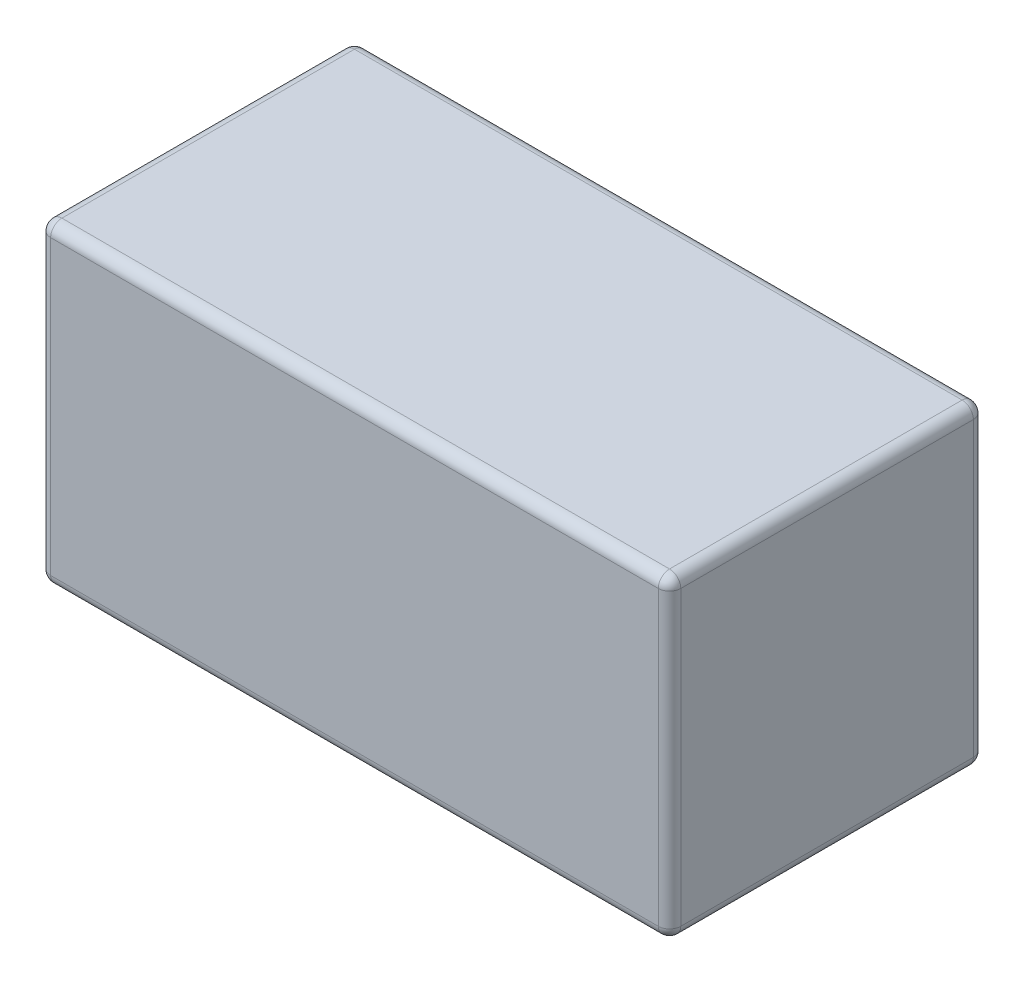
ISO-10303-21;
HEADER;
FILE_DESCRIPTION(('STEP AP214'),'2;1');
FILE_NAME('part.step','',(''),(''),'','','');
FILE_SCHEMA(('AUTOMOTIVE_DESIGN { 1 0 10303 214 1 1 1 1 }'));
ENDSEC;
DATA;
#1=APPLICATION_CONTEXT('core data for automotive mechanical design processes');
#2=APPLICATION_PROTOCOL_DEFINITION('international standard','automotive_design',2000,#1);
#3=PRODUCT_CONTEXT('',#1,'mechanical');
#4=PRODUCT('Part','Part','',(#3));
#5=PRODUCT_RELATED_PRODUCT_CATEGORY('part','',(#4));
#6=PRODUCT_DEFINITION_FORMATION('','',#4);
#7=PRODUCT_DEFINITION_CONTEXT('part definition',#1,'design');
#8=PRODUCT_DEFINITION('design','',#6,#7);
#9=PRODUCT_DEFINITION_SHAPE('','',#8);
#10=(LENGTH_UNIT() NAMED_UNIT(*) SI_UNIT(.MILLI.,.METRE.));
#11=(NAMED_UNIT(*) PLANE_ANGLE_UNIT() SI_UNIT($,.RADIAN.));
#12=(NAMED_UNIT(*) SI_UNIT($,.STERADIAN.) SOLID_ANGLE_UNIT());
#13=UNCERTAINTY_MEASURE_WITH_UNIT(LENGTH_MEASURE(1.E-05),#10,'distance_accuracy_value','');
#14=(GEOMETRIC_REPRESENTATION_CONTEXT(3) GLOBAL_UNCERTAINTY_ASSIGNED_CONTEXT((#13)) GLOBAL_UNIT_ASSIGNED_CONTEXT((#10,
#11,#12)) REPRESENTATION_CONTEXT('',''));
#15=CARTESIAN_POINT('',(0.,0.,0.));
#16=DIRECTION('',(0.,0.,1.));
#17=DIRECTION('',(1.,0.,0.));
#18=AXIS2_PLACEMENT_3D('',#15,#16,#17);
#19=CARTESIAN_POINT('',(0.,35.56,0.));
#20=DIRECTION('',(1.,0.,0.));
#21=DIRECTION('',(0.,0.,-1.));
#22=AXIS2_PLACEMENT_3D('',#19,#20,#21);
#23=PLANE('',#22);
#24=DIRECTION('',(0.,-1.,0.));
#25=VECTOR('',#24,1.);
#26=CARTESIAN_POINT('',(0.,35.56,-34.29));
#27=LINE('',#26,#25);
#28=CARTESIAN_POINT('',(0.,34.29,-34.29));
#29=VERTEX_POINT('',#28);
#30=CARTESIAN_POINT('',(0.,1.27,-34.29));
#31=VERTEX_POINT('',#30);
#32=EDGE_CURVE('E143',#29,#31,#27,.T.);
#33=ORIENTED_EDGE('',*,*,#32,.T.);
#34=DIRECTION('',(0.,0.,1.));
#35=VECTOR('',#34,1.);
#36=CARTESIAN_POINT('',(0.,1.27,0.));
#37=LINE('',#36,#35);
#38=CARTESIAN_POINT('',(0.,1.27,-1.27));
#39=VERTEX_POINT('',#38);
#40=EDGE_CURVE('E138',#31,#39,#37,.T.);
#41=ORIENTED_EDGE('',*,*,#40,.T.);
#42=DIRECTION('',(0.,-1.,0.));
#43=VECTOR('',#42,1.);
#44=CARTESIAN_POINT('',(0.,35.56,-1.27));
#45=LINE('',#44,#43);
#46=CARTESIAN_POINT('',(0.,34.29,-1.27));
#47=VERTEX_POINT('',#46);
#48=EDGE_CURVE('E133',#39,#47,#45,.F.);
#49=ORIENTED_EDGE('',*,*,#48,.T.);
#50=DIRECTION('',(0.,0.,1.));
#51=VECTOR('',#50,1.);
#52=CARTESIAN_POINT('',(0.,34.29,0.));
#53=LINE('',#52,#51);
#54=EDGE_CURVE('E135',#47,#29,#53,.F.);
#55=ORIENTED_EDGE('',*,*,#54,.T.);
#56=EDGE_LOOP('',(#33,#41,#49,#55));
#57=FACE_BOUND('',#56,.T.);
#58=ADVANCED_FACE('F43',(#57),#23,.F.);
#59=CARTESIAN_POINT('',(0.,35.56,0.));
#60=DIRECTION('',(0.,0.,-1.));
#61=DIRECTION('',(-1.,0.,0.));
#62=AXIS2_PLACEMENT_3D('',#59,#60,#61);
#63=PLANE('',#62);
#64=DIRECTION('',(0.,-1.,0.));
#65=VECTOR('',#64,1.);
#66=CARTESIAN_POINT('',(1.27,35.56,0.));
#67=LINE('',#66,#65);
#68=CARTESIAN_POINT('',(1.27,34.29,0.));
#69=VERTEX_POINT('',#68);
#70=CARTESIAN_POINT('',(1.27,1.27,0.));
#71=VERTEX_POINT('',#70);
#72=EDGE_CURVE('E166',#69,#71,#67,.T.);
#73=ORIENTED_EDGE('',*,*,#72,.T.);
#74=DIRECTION('',(1.,0.,0.));
#75=VECTOR('',#74,1.);
#76=CARTESIAN_POINT('',(71.12,1.27,0.));
#77=LINE('',#76,#75);
#78=CARTESIAN_POINT('',(69.85,1.27,0.));
#79=VERTEX_POINT('',#78);
#80=EDGE_CURVE('E266',#71,#79,#77,.T.);
#81=ORIENTED_EDGE('',*,*,#80,.T.);
#82=DIRECTION('',(0.,-1.,0.));
#83=VECTOR('',#82,1.);
#84=CARTESIAN_POINT('',(69.85,35.56,0.));
#85=LINE('',#84,#83);
#86=CARTESIAN_POINT('',(69.85,34.29,0.));
#87=VERTEX_POINT('',#86);
#88=EDGE_CURVE('E257',#79,#87,#85,.F.);
#89=ORIENTED_EDGE('',*,*,#88,.T.);
#90=DIRECTION('',(1.,0.,0.));
#91=VECTOR('',#90,1.);
#92=CARTESIAN_POINT('',(0.,34.29,0.));
#93=LINE('',#92,#91);
#94=EDGE_CURVE('E253',#87,#69,#93,.F.);
#95=ORIENTED_EDGE('',*,*,#94,.T.);
#96=EDGE_LOOP('',(#73,#81,#89,#95));
#97=FACE_BOUND('',#96,.T.);
#98=ADVANCED_FACE('F378',(#97),#63,.F.);
#99=CARTESIAN_POINT('',(71.12,35.56,0.));
#100=DIRECTION('',(-1.,0.,0.));
#101=DIRECTION('',(0.,0.,1.));
#102=AXIS2_PLACEMENT_3D('',#99,#100,#101);
#103=PLANE('',#102);
#104=DIRECTION('',(0.,0.,-1.));
#105=VECTOR('',#104,1.);
#106=CARTESIAN_POINT('',(71.12,1.27,-35.56));
#107=LINE('',#106,#105);
#108=CARTESIAN_POINT('',(71.12,1.27,-1.27));
#109=VERTEX_POINT('',#108);
#110=CARTESIAN_POINT('',(71.12,1.27,-34.29));
#111=VERTEX_POINT('',#110);
#112=EDGE_CURVE('E248',#109,#111,#107,.T.);
#113=ORIENTED_EDGE('',*,*,#112,.T.);
#114=DIRECTION('',(0.,-1.,0.));
#115=VECTOR('',#114,1.);
#116=CARTESIAN_POINT('',(71.12,35.56,-34.29));
#117=LINE('',#116,#115);
#118=CARTESIAN_POINT('',(71.12,34.29,-34.29));
#119=VERTEX_POINT('',#118);
#120=EDGE_CURVE('E245',#111,#119,#117,.F.);
#121=ORIENTED_EDGE('',*,*,#120,.T.);
#122=DIRECTION('',(0.,0.,-1.));
#123=VECTOR('',#122,1.);
#124=CARTESIAN_POINT('',(71.12,34.29,0.));
#125=LINE('',#124,#123);
#126=CARTESIAN_POINT('',(71.12,34.29,-1.27));
#127=VERTEX_POINT('',#126);
#128=EDGE_CURVE('E237',#119,#127,#125,.F.);
#129=ORIENTED_EDGE('',*,*,#128,.T.);
#130=DIRECTION('',(0.,-1.,0.));
#131=VECTOR('',#130,1.);
#132=CARTESIAN_POINT('',(71.12,35.56,-1.27));
#133=LINE('',#132,#131);
#134=EDGE_CURVE('E241',#127,#109,#133,.T.);
#135=ORIENTED_EDGE('',*,*,#134,.T.);
#136=EDGE_LOOP('',(#113,#121,#129,#135));
#137=FACE_BOUND('',#136,.T.);
#138=ADVANCED_FACE('F246',(#137),#103,.F.);
#139=CARTESIAN_POINT('',(0.,35.56,-35.56));
#140=DIRECTION('',(0.,0.,1.));
#141=DIRECTION('',(1.,0.,0.));
#142=AXIS2_PLACEMENT_3D('',#139,#140,#141);
#143=PLANE('',#142);
#144=DIRECTION('',(0.,-1.,0.));
#145=VECTOR('',#144,1.);
#146=CARTESIAN_POINT('',(69.85,35.56,-35.56));
#147=LINE('',#146,#145);
#148=CARTESIAN_POINT('',(69.85,34.29,-35.56));
#149=VERTEX_POINT('',#148);
#150=CARTESIAN_POINT('',(69.85,1.27,-35.56));
#151=VERTEX_POINT('',#150);
#152=EDGE_CURVE('E325',#149,#151,#147,.T.);
#153=ORIENTED_EDGE('',*,*,#152,.T.);
#154=DIRECTION('',(-1.,0.,0.));
#155=VECTOR('',#154,1.);
#156=CARTESIAN_POINT('',(0.,1.27,-35.56));
#157=LINE('',#156,#155);
#158=CARTESIAN_POINT('',(1.27,1.27,-35.56));
#159=VERTEX_POINT('',#158);
#160=EDGE_CURVE('E242',#151,#159,#157,.T.);
#161=ORIENTED_EDGE('',*,*,#160,.T.);
#162=DIRECTION('',(0.,-1.,0.));
#163=VECTOR('',#162,1.);
#164=CARTESIAN_POINT('',(1.27,35.56,-35.56));
#165=LINE('',#164,#163);
#166=CARTESIAN_POINT('',(1.27,34.29,-35.56));
#167=VERTEX_POINT('',#166);
#168=EDGE_CURVE('E331',#159,#167,#165,.F.);
#169=ORIENTED_EDGE('',*,*,#168,.T.);
#170=DIRECTION('',(-1.,0.,0.));
#171=VECTOR('',#170,1.);
#172=CARTESIAN_POINT('',(0.,34.29,-35.56));
#173=LINE('',#172,#171);
#174=EDGE_CURVE('E322',#167,#149,#173,.F.);
#175=ORIENTED_EDGE('',*,*,#174,.T.);
#176=EDGE_LOOP('',(#153,#161,#169,#175));
#177=FACE_BOUND('',#176,.T.);
#178=ADVANCED_FACE('F363',(#177),#143,.F.);
#179=CARTESIAN_POINT('',(0.,35.56,0.));
#180=DIRECTION('',(0.,-1.,0.));
#181=DIRECTION('',(0.,0.,-1.));
#182=AXIS2_PLACEMENT_3D('',#179,#180,#181);
#183=PLANE('',#182);
#184=DIRECTION('',(-1.,0.,0.));
#185=VECTOR('',#184,1.);
#186=CARTESIAN_POINT('',(0.,35.56,-34.29));
#187=LINE('',#186,#185);
#188=CARTESIAN_POINT('',(69.85,35.56,-34.29));
#189=VERTEX_POINT('',#188);
#190=CARTESIAN_POINT('',(1.27,35.56,-34.29));
#191=VERTEX_POINT('',#190);
#192=EDGE_CURVE('E53',#189,#191,#187,.T.);
#193=ORIENTED_EDGE('',*,*,#192,.T.);
#194=DIRECTION('',(0.,0.,1.));
#195=VECTOR('',#194,1.);
#196=CARTESIAN_POINT('',(1.27,35.56,0.));
#197=LINE('',#196,#195);
#198=CARTESIAN_POINT('',(1.27,35.56,-1.27));
#199=VERTEX_POINT('',#198);
#200=EDGE_CURVE('E11',#191,#199,#197,.T.);
#201=ORIENTED_EDGE('',*,*,#200,.T.);
#202=DIRECTION('',(1.,0.,0.));
#203=VECTOR('',#202,1.);
#204=CARTESIAN_POINT('',(0.,35.56,-1.27));
#205=LINE('',#204,#203);
#206=CARTESIAN_POINT('',(69.85,35.56,-1.27));
#207=VERTEX_POINT('',#206);
#208=EDGE_CURVE('E270',#199,#207,#205,.T.);
#209=ORIENTED_EDGE('',*,*,#208,.T.);
#210=DIRECTION('',(0.,0.,-1.));
#211=VECTOR('',#210,1.);
#212=CARTESIAN_POINT('',(69.85,35.56,0.));
#213=LINE('',#212,#211);
#214=EDGE_CURVE('E64',#207,#189,#213,.T.);
#215=ORIENTED_EDGE('',*,*,#214,.T.);
#216=EDGE_LOOP('',(#193,#201,#209,#215));
#217=FACE_BOUND('',#216,.T.);
#218=ADVANCED_FACE('F582',(#217),#183,.F.);
#219=CARTESIAN_POINT('',(0.,0.,0.));
#220=DIRECTION('',(0.,-1.,0.));
#221=DIRECTION('',(0.,0.,-1.));
#222=AXIS2_PLACEMENT_3D('',#219,#220,#221);
#223=PLANE('',#222);
#224=DIRECTION('',(1.,0.,0.));
#225=VECTOR('',#224,1.);
#226=CARTESIAN_POINT('',(0.,0.,-1.27));
#227=LINE('',#226,#225);
#228=CARTESIAN_POINT('',(69.85,0.,-1.27));
#229=VERTEX_POINT('',#228);
#230=CARTESIAN_POINT('',(1.27,0.,-1.27));
#231=VERTEX_POINT('',#230);
#232=EDGE_CURVE('E317',#229,#231,#227,.F.);
#233=ORIENTED_EDGE('',*,*,#232,.T.);
#234=DIRECTION('',(0.,0.,1.));
#235=VECTOR('',#234,1.);
#236=CARTESIAN_POINT('',(1.27,0.,-35.56));
#237=LINE('',#236,#235);
#238=CARTESIAN_POINT('',(1.27,0.,-34.29));
#239=VERTEX_POINT('',#238);
#240=EDGE_CURVE('E311',#231,#239,#237,.F.);
#241=ORIENTED_EDGE('',*,*,#240,.T.);
#242=DIRECTION('',(-1.,0.,0.));
#243=VECTOR('',#242,1.);
#244=CARTESIAN_POINT('',(71.12,0.,-34.29));
#245=LINE('',#244,#243);
#246=CARTESIAN_POINT('',(69.85,0.,-34.29));
#247=VERTEX_POINT('',#246);
#248=EDGE_CURVE('E304',#239,#247,#245,.F.);
#249=ORIENTED_EDGE('',*,*,#248,.T.);
#250=DIRECTION('',(0.,0.,-1.));
#251=VECTOR('',#250,1.);
#252=CARTESIAN_POINT('',(69.85,0.,0.));
#253=LINE('',#252,#251);
#254=EDGE_CURVE('E312',#247,#229,#253,.F.);
#255=ORIENTED_EDGE('',*,*,#254,.T.);
#256=EDGE_LOOP('',(#233,#241,#249,#255));
#257=FACE_BOUND('',#256,.T.);
#258=ADVANCED_FACE('F315',(#257),#223,.T.);
#259=CARTESIAN_POINT('',(69.85,34.29,0.));
#260=DIRECTION('',(0.,0.,-1.));
#261=DIRECTION('',(-1.,0.,0.));
#262=AXIS2_PLACEMENT_3D('',#259,#260,#261);
#263=CYLINDRICAL_SURFACE('',#262,1.27);
#264=CARTESIAN_POINT('',(69.85,34.29,-34.29));
#265=DIRECTION('',(0.,0.,-1.));
#266=DIRECTION('',(-1.,0.,0.));
#267=AXIS2_PLACEMENT_3D('',#264,#265,#266);
#268=CIRCLE('',#267,1.27);
#269=EDGE_CURVE('E47',#189,#119,#268,.T.);
#270=ORIENTED_EDGE('',*,*,#269,.F.);
#271=ORIENTED_EDGE('',*,*,#214,.F.);
#272=CARTESIAN_POINT('',(69.85,34.29,-1.27));
#273=DIRECTION('',(0.,0.,1.));
#274=DIRECTION('',(1.,0.,0.));
#275=AXIS2_PLACEMENT_3D('',#272,#273,#274);
#276=CIRCLE('',#275,1.27);
#277=EDGE_CURVE('E221',#127,#207,#276,.T.);
#278=ORIENTED_EDGE('',*,*,#277,.F.);
#279=ORIENTED_EDGE('',*,*,#128,.F.);
#280=EDGE_LOOP('',(#270,#271,#278,#279));
#281=FACE_BOUND('',#280,.T.);
#282=ADVANCED_FACE('F45',(#281),#263,.T.);
#283=CARTESIAN_POINT('',(69.85,34.29,-34.29));
#284=DIRECTION('',(1.,0.,0.));
#285=DIRECTION('',(0.,0.,-1.));
#286=AXIS2_PLACEMENT_3D('',#283,#284,#285);
#287=SPHERICAL_SURFACE('',#286,1.27);
#288=CARTESIAN_POINT('',(69.85,34.29,-34.29));
#289=DIRECTION('',(1.,0.,0.));
#290=DIRECTION('',(0.,0.,-1.));
#291=AXIS2_PLACEMENT_3D('',#288,#289,#290);
#292=CIRCLE('',#291,1.27);
#293=EDGE_CURVE('E215',#189,#149,#292,.F.);
#294=ORIENTED_EDGE('',*,*,#293,.F.);
#295=ORIENTED_EDGE('',*,*,#269,.T.);
#296=CARTESIAN_POINT('',(69.85,34.29,-34.29));
#297=DIRECTION('',(0.,1.,0.));
#298=DIRECTION('',(0.,0.,1.));
#299=AXIS2_PLACEMENT_3D('',#296,#297,#298);
#300=CIRCLE('',#299,1.27);
#301=EDGE_CURVE('E219',#149,#119,#300,.F.);
#302=ORIENTED_EDGE('',*,*,#301,.F.);
#303=EDGE_LOOP('',(#294,#295,#302));
#304=FACE_BOUND('',#303,.T.);
#305=ADVANCED_FACE('F234',(#304),#287,.T.);
#306=CARTESIAN_POINT('',(69.85,34.29,-1.27));
#307=DIRECTION('',(0.,1.,0.));
#308=DIRECTION('',(0.,0.,1.));
#309=AXIS2_PLACEMENT_3D('',#306,#307,#308);
#310=SPHERICAL_SURFACE('',#309,1.27);
#311=CARTESIAN_POINT('',(69.85,34.29,-1.27));
#312=DIRECTION('',(0.,1.,0.));
#313=DIRECTION('',(0.,0.,1.));
#314=AXIS2_PLACEMENT_3D('',#311,#312,#313);
#315=CIRCLE('',#314,1.27);
#316=EDGE_CURVE('E207',#127,#87,#315,.F.);
#317=ORIENTED_EDGE('',*,*,#316,.F.);
#318=ORIENTED_EDGE('',*,*,#277,.T.);
#319=CARTESIAN_POINT('',(69.85,34.29,-1.27));
#320=DIRECTION('',(1.,0.,0.));
#321=DIRECTION('',(0.,0.,-1.));
#322=AXIS2_PLACEMENT_3D('',#319,#320,#321);
#323=CIRCLE('',#322,1.27);
#324=EDGE_CURVE('E211',#87,#207,#323,.F.);
#325=ORIENTED_EDGE('',*,*,#324,.F.);
#326=EDGE_LOOP('',(#317,#318,#325));
#327=FACE_BOUND('',#326,.T.);
#328=ADVANCED_FACE('F547',(#327),#310,.T.);
#329=CARTESIAN_POINT('',(69.85,35.56,-34.29));
#330=DIRECTION('',(0.,-1.,0.));
#331=DIRECTION('',(0.,0.,-1.));
#332=AXIS2_PLACEMENT_3D('',#329,#330,#331);
#333=CYLINDRICAL_SURFACE('',#332,1.27);
#334=ORIENTED_EDGE('',*,*,#301,.T.);
#335=ORIENTED_EDGE('',*,*,#120,.F.);
#336=CARTESIAN_POINT('',(69.85,1.27,-34.29));
#337=DIRECTION('',(0.,-1.,0.));
#338=DIRECTION('',(0.,0.,-1.));
#339=AXIS2_PLACEMENT_3D('',#336,#337,#338);
#340=CIRCLE('',#339,1.27);
#341=EDGE_CURVE('E199',#151,#111,#340,.T.);
#342=ORIENTED_EDGE('',*,*,#341,.F.);
#343=ORIENTED_EDGE('',*,*,#152,.F.);
#344=EDGE_LOOP('',(#334,#335,#342,#343));
#345=FACE_BOUND('',#344,.T.);
#346=ADVANCED_FACE('F364',(#345),#333,.T.);
#347=CARTESIAN_POINT('',(0.,34.29,-34.29));
#348=DIRECTION('',(-1.,0.,0.));
#349=DIRECTION('',(0.,0.,1.));
#350=AXIS2_PLACEMENT_3D('',#347,#348,#349);
#351=CYLINDRICAL_SURFACE('',#350,1.27);
#352=ORIENTED_EDGE('',*,*,#293,.T.);
#353=ORIENTED_EDGE('',*,*,#174,.F.);
#354=CARTESIAN_POINT('',(1.27,34.29,-34.29));
#355=DIRECTION('',(-1.,0.,0.));
#356=DIRECTION('',(0.,0.,1.));
#357=AXIS2_PLACEMENT_3D('',#354,#355,#356);
#358=CIRCLE('',#357,1.27);
#359=EDGE_CURVE('E195',#191,#167,#358,.T.);
#360=ORIENTED_EDGE('',*,*,#359,.F.);
#361=ORIENTED_EDGE('',*,*,#192,.F.);
#362=EDGE_LOOP('',(#352,#353,#360,#361));
#363=FACE_BOUND('',#362,.T.);
#364=ADVANCED_FACE('F527',(#363),#351,.T.);
#365=CARTESIAN_POINT('',(1.27,34.29,0.));
#366=DIRECTION('',(0.,0.,1.));
#367=DIRECTION('',(1.,0.,0.));
#368=AXIS2_PLACEMENT_3D('',#365,#366,#367);
#369=CYLINDRICAL_SURFACE('',#368,1.27);
#370=CARTESIAN_POINT('',(1.27,34.29,-1.27));
#371=DIRECTION('',(0.,0.,1.));
#372=DIRECTION('',(1.,0.,0.));
#373=AXIS2_PLACEMENT_3D('',#370,#371,#372);
#374=CIRCLE('',#373,1.27);
#375=EDGE_CURVE('E149',#199,#47,#374,.T.);
#376=ORIENTED_EDGE('',*,*,#375,.F.);
#377=ORIENTED_EDGE('',*,*,#200,.F.);
#378=CARTESIAN_POINT('',(1.27,34.29,-34.29));
#379=DIRECTION('',(0.,0.,-1.));
#380=DIRECTION('',(-1.,0.,0.));
#381=AXIS2_PLACEMENT_3D('',#378,#379,#380);
#382=CIRCLE('',#381,1.27);
#383=EDGE_CURVE('E152',#29,#191,#382,.T.);
#384=ORIENTED_EDGE('',*,*,#383,.F.);
#385=ORIENTED_EDGE('',*,*,#54,.F.);
#386=EDGE_LOOP('',(#376,#377,#384,#385));
#387=FACE_BOUND('',#386,.T.);
#388=ADVANCED_FACE('F148',(#387),#369,.T.);
#389=CARTESIAN_POINT('',(0.,34.29,-1.27));
#390=DIRECTION('',(1.,0.,0.));
#391=DIRECTION('',(0.,0.,-1.));
#392=AXIS2_PLACEMENT_3D('',#389,#390,#391);
#393=CYLINDRICAL_SURFACE('',#392,1.27);
#394=ORIENTED_EDGE('',*,*,#324,.T.);
#395=ORIENTED_EDGE('',*,*,#208,.F.);
#396=CARTESIAN_POINT('',(1.27,34.29,-1.27));
#397=DIRECTION('',(-1.,0.,0.));
#398=DIRECTION('',(0.,0.,1.));
#399=AXIS2_PLACEMENT_3D('',#396,#397,#398);
#400=CIRCLE('',#399,1.27);
#401=EDGE_CURVE('E162',#69,#199,#400,.T.);
#402=ORIENTED_EDGE('',*,*,#401,.F.);
#403=ORIENTED_EDGE('',*,*,#94,.F.);
#404=EDGE_LOOP('',(#394,#395,#402,#403));
#405=FACE_BOUND('',#404,.T.);
#406=ADVANCED_FACE('F507',(#405),#393,.T.);
#407=CARTESIAN_POINT('',(69.85,35.56,-1.27));
#408=DIRECTION('',(0.,-1.,0.));
#409=DIRECTION('',(0.,0.,-1.));
#410=AXIS2_PLACEMENT_3D('',#407,#408,#409);
#411=CYLINDRICAL_SURFACE('',#410,1.27);
#412=ORIENTED_EDGE('',*,*,#316,.T.);
#413=ORIENTED_EDGE('',*,*,#88,.F.);
#414=CARTESIAN_POINT('',(69.85,1.27,-1.27));
#415=DIRECTION('',(0.,-1.,0.));
#416=DIRECTION('',(0.,0.,-1.));
#417=AXIS2_PLACEMENT_3D('',#414,#415,#416);
#418=CIRCLE('',#417,1.27);
#419=EDGE_CURVE('E187',#109,#79,#418,.T.);
#420=ORIENTED_EDGE('',*,*,#419,.F.);
#421=ORIENTED_EDGE('',*,*,#134,.F.);
#422=EDGE_LOOP('',(#412,#413,#420,#421));
#423=FACE_BOUND('',#422,.T.);
#424=ADVANCED_FACE('F345',(#423),#411,.T.);
#425=CARTESIAN_POINT('',(69.85,1.27,0.));
#426=DIRECTION('',(0.,0.,1.));
#427=DIRECTION('',(1.,0.,0.));
#428=AXIS2_PLACEMENT_3D('',#425,#426,#427);
#429=CYLINDRICAL_SURFACE('',#428,1.27);
#430=CARTESIAN_POINT('',(69.85,1.27,-34.29));
#431=DIRECTION('',(0.,0.,-1.));
#432=DIRECTION('',(-1.,0.,0.));
#433=AXIS2_PLACEMENT_3D('',#430,#431,#432);
#434=CIRCLE('',#433,1.27);
#435=EDGE_CURVE('E203',#111,#247,#434,.T.);
#436=ORIENTED_EDGE('',*,*,#435,.F.);
#437=ORIENTED_EDGE('',*,*,#112,.F.);
#438=CARTESIAN_POINT('',(69.85,1.27,-1.27));
#439=DIRECTION('',(0.,0.,1.));
#440=DIRECTION('',(1.,0.,0.));
#441=AXIS2_PLACEMENT_3D('',#438,#439,#440);
#442=CIRCLE('',#441,1.27);
#443=EDGE_CURVE('E183',#229,#109,#442,.T.);
#444=ORIENTED_EDGE('',*,*,#443,.F.);
#445=ORIENTED_EDGE('',*,*,#254,.F.);
#446=EDGE_LOOP('',(#436,#437,#444,#445));
#447=FACE_BOUND('',#446,.T.);
#448=ADVANCED_FACE('F342',(#447),#429,.T.);
#449=CARTESIAN_POINT('',(69.85,1.27,-34.29));
#450=DIRECTION('',(1.,0.,0.));
#451=DIRECTION('',(0.,1.,0.));
#452=AXIS2_PLACEMENT_3D('',#449,#450,#451);
#453=SPHERICAL_SURFACE('',#452,1.27);
#454=ORIENTED_EDGE('',*,*,#341,.T.);
#455=ORIENTED_EDGE('',*,*,#435,.T.);
#456=CARTESIAN_POINT('',(69.85,1.27,-34.29));
#457=DIRECTION('',(1.,0.,0.));
#458=DIRECTION('',(0.,0.,-1.));
#459=AXIS2_PLACEMENT_3D('',#456,#457,#458);
#460=CIRCLE('',#459,1.27);
#461=EDGE_CURVE('E174',#151,#247,#460,.F.);
#462=ORIENTED_EDGE('',*,*,#461,.F.);
#463=EDGE_LOOP('',(#454,#455,#462));
#464=FACE_BOUND('',#463,.T.);
#465=ADVANCED_FACE('F366',(#464),#453,.T.);
#466=CARTESIAN_POINT('',(1.27,34.29,-34.29));
#467=DIRECTION('',(0.,1.,0.));
#468=DIRECTION('',(0.,0.,1.));
#469=AXIS2_PLACEMENT_3D('',#466,#467,#468);
#470=SPHERICAL_SURFACE('',#469,1.27);
#471=ORIENTED_EDGE('',*,*,#383,.T.);
#472=ORIENTED_EDGE('',*,*,#359,.T.);
#473=CARTESIAN_POINT('',(1.27,34.29,-34.29));
#474=DIRECTION('',(0.,1.,0.));
#475=DIRECTION('',(0.,0.,1.));
#476=AXIS2_PLACEMENT_3D('',#473,#474,#475);
#477=CIRCLE('',#476,1.27);
#478=EDGE_CURVE('E168',#29,#167,#477,.F.);
#479=ORIENTED_EDGE('',*,*,#478,.F.);
#480=EDGE_LOOP('',(#471,#472,#479));
#481=FACE_BOUND('',#480,.T.);
#482=ADVANCED_FACE('F368',(#481),#470,.T.);
#483=CARTESIAN_POINT('',(1.27,34.29,-1.27));
#484=DIRECTION('',(0.,1.,0.));
#485=DIRECTION('',(0.,0.,1.));
#486=AXIS2_PLACEMENT_3D('',#483,#484,#485);
#487=SPHERICAL_SURFACE('',#486,1.27);
#488=ORIENTED_EDGE('',*,*,#401,.T.);
#489=ORIENTED_EDGE('',*,*,#375,.T.);
#490=CARTESIAN_POINT('',(1.27,34.29,-1.27));
#491=DIRECTION('',(0.,1.,0.));
#492=DIRECTION('',(0.,0.,1.));
#493=AXIS2_PLACEMENT_3D('',#490,#491,#492);
#494=CIRCLE('',#493,1.27);
#495=EDGE_CURVE('E159',#69,#47,#494,.F.);
#496=ORIENTED_EDGE('',*,*,#495,.F.);
#497=EDGE_LOOP('',(#488,#489,#496));
#498=FACE_BOUND('',#497,.T.);
#499=ADVANCED_FACE('F158',(#498),#487,.T.);
#500=CARTESIAN_POINT('',(69.85,1.27,-1.27));
#501=DIRECTION('',(1.,0.,0.));
#502=DIRECTION('',(0.,1.,0.));
#503=AXIS2_PLACEMENT_3D('',#500,#501,#502);
#504=SPHERICAL_SURFACE('',#503,1.27);
#505=ORIENTED_EDGE('',*,*,#443,.T.);
#506=ORIENTED_EDGE('',*,*,#419,.T.);
#507=CARTESIAN_POINT('',(69.85,1.27,-1.27));
#508=DIRECTION('',(1.,0.,0.));
#509=DIRECTION('',(0.,0.,-1.));
#510=AXIS2_PLACEMENT_3D('',#507,#508,#509);
#511=CIRCLE('',#510,1.27);
#512=EDGE_CURVE('E169',#229,#79,#511,.F.);
#513=ORIENTED_EDGE('',*,*,#512,.F.);
#514=EDGE_LOOP('',(#505,#506,#513));
#515=FACE_BOUND('',#514,.T.);
#516=ADVANCED_FACE('F347',(#515),#504,.T.);
#517=CARTESIAN_POINT('',(0.,1.27,-34.29));
#518=DIRECTION('',(1.,0.,0.));
#519=DIRECTION('',(0.,0.,-1.));
#520=AXIS2_PLACEMENT_3D('',#517,#518,#519);
#521=CYLINDRICAL_SURFACE('',#520,1.27);
#522=ORIENTED_EDGE('',*,*,#461,.T.);
#523=ORIENTED_EDGE('',*,*,#248,.F.);
#524=CARTESIAN_POINT('',(1.27,1.27,-34.29));
#525=DIRECTION('',(-1.,0.,0.));
#526=DIRECTION('',(0.,0.,1.));
#527=AXIS2_PLACEMENT_3D('',#524,#525,#526);
#528=CIRCLE('',#527,1.27);
#529=EDGE_CURVE('E176',#159,#239,#528,.T.);
#530=ORIENTED_EDGE('',*,*,#529,.F.);
#531=ORIENTED_EDGE('',*,*,#160,.F.);
#532=EDGE_LOOP('',(#522,#523,#530,#531));
#533=FACE_BOUND('',#532,.T.);
#534=ADVANCED_FACE('F306',(#533),#521,.T.);
#535=CARTESIAN_POINT('',(1.27,35.56,-34.29));
#536=DIRECTION('',(0.,-1.,0.));
#537=DIRECTION('',(0.,0.,-1.));
#538=AXIS2_PLACEMENT_3D('',#535,#536,#537);
#539=CYLINDRICAL_SURFACE('',#538,1.27);
#540=ORIENTED_EDGE('',*,*,#478,.T.);
#541=ORIENTED_EDGE('',*,*,#168,.F.);
#542=CARTESIAN_POINT('',(1.27,1.27,-34.29));
#543=DIRECTION('',(0.,-1.,0.));
#544=DIRECTION('',(0.,0.,-1.));
#545=AXIS2_PLACEMENT_3D('',#542,#543,#544);
#546=CIRCLE('',#545,1.27);
#547=EDGE_CURVE('E291',#31,#159,#546,.T.);
#548=ORIENTED_EDGE('',*,*,#547,.F.);
#549=ORIENTED_EDGE('',*,*,#32,.F.);
#550=EDGE_LOOP('',(#540,#541,#548,#549));
#551=FACE_BOUND('',#550,.T.);
#552=ADVANCED_FACE('F360',(#551),#539,.T.);
#553=CARTESIAN_POINT('',(1.27,35.56,-1.27));
#554=DIRECTION('',(0.,-1.,0.));
#555=DIRECTION('',(0.,0.,-1.));
#556=AXIS2_PLACEMENT_3D('',#553,#554,#555);
#557=CYLINDRICAL_SURFACE('',#556,1.27);
#558=ORIENTED_EDGE('',*,*,#495,.T.);
#559=ORIENTED_EDGE('',*,*,#48,.F.);
#560=CARTESIAN_POINT('',(1.27,1.27,-1.27));
#561=DIRECTION('',(0.,-1.,0.));
#562=DIRECTION('',(0.,0.,-1.));
#563=AXIS2_PLACEMENT_3D('',#560,#561,#562);
#564=CIRCLE('',#563,1.27);
#565=EDGE_CURVE('E287',#71,#39,#564,.T.);
#566=ORIENTED_EDGE('',*,*,#565,.F.);
#567=ORIENTED_EDGE('',*,*,#72,.F.);
#568=EDGE_LOOP('',(#558,#559,#566,#567));
#569=FACE_BOUND('',#568,.T.);
#570=ADVANCED_FACE('F165',(#569),#557,.T.);
#571=CARTESIAN_POINT('',(0.,1.27,-1.27));
#572=DIRECTION('',(-1.,0.,0.));
#573=DIRECTION('',(0.,0.,1.));
#574=AXIS2_PLACEMENT_3D('',#571,#572,#573);
#575=CYLINDRICAL_SURFACE('',#574,1.27);
#576=ORIENTED_EDGE('',*,*,#512,.T.);
#577=ORIENTED_EDGE('',*,*,#80,.F.);
#578=CARTESIAN_POINT('',(1.27,1.27,-1.27));
#579=DIRECTION('',(-1.,0.,0.));
#580=DIRECTION('',(0.,0.,1.));
#581=AXIS2_PLACEMENT_3D('',#578,#579,#580);
#582=CIRCLE('',#581,1.27);
#583=EDGE_CURVE('E283',#231,#71,#582,.T.);
#584=ORIENTED_EDGE('',*,*,#583,.F.);
#585=ORIENTED_EDGE('',*,*,#232,.F.);
#586=EDGE_LOOP('',(#576,#577,#584,#585));
#587=FACE_BOUND('',#586,.T.);
#588=ADVANCED_FACE('F350',(#587),#575,.T.);
#589=CARTESIAN_POINT('',(1.27,1.27,-34.29));
#590=DIRECTION('',(0.,0.,-1.));
#591=DIRECTION('',(0.,1.,0.));
#592=AXIS2_PLACEMENT_3D('',#589,#590,#591);
#593=SPHERICAL_SURFACE('',#592,1.27);
#594=ORIENTED_EDGE('',*,*,#547,.T.);
#595=ORIENTED_EDGE('',*,*,#529,.T.);
#596=CARTESIAN_POINT('',(1.27,1.27,-34.29));
#597=DIRECTION('',(0.,0.,-1.));
#598=DIRECTION('',(-1.,0.,0.));
#599=AXIS2_PLACEMENT_3D('',#596,#597,#598);
#600=CIRCLE('',#599,1.27);
#601=EDGE_CURVE('E280',#31,#239,#600,.F.);
#602=ORIENTED_EDGE('',*,*,#601,.F.);
#603=EDGE_LOOP('',(#594,#595,#602));
#604=FACE_BOUND('',#603,.T.);
#605=ADVANCED_FACE('F299',(#604),#593,.T.);
#606=CARTESIAN_POINT('',(1.27,1.27,-1.27));
#607=DIRECTION('',(0.,0.,1.));
#608=DIRECTION('',(0.,-1.,0.));
#609=AXIS2_PLACEMENT_3D('',#606,#607,#608);
#610=SPHERICAL_SURFACE('',#609,1.27);
#611=ORIENTED_EDGE('',*,*,#583,.T.);
#612=ORIENTED_EDGE('',*,*,#565,.T.);
#613=CARTESIAN_POINT('',(1.27,1.27,-1.27));
#614=DIRECTION('',(0.,0.,1.));
#615=DIRECTION('',(1.,0.,0.));
#616=AXIS2_PLACEMENT_3D('',#613,#614,#615);
#617=CIRCLE('',#616,1.27);
#618=EDGE_CURVE('E277',#231,#39,#617,.F.);
#619=ORIENTED_EDGE('',*,*,#618,.F.);
#620=EDGE_LOOP('',(#611,#612,#619));
#621=FACE_BOUND('',#620,.T.);
#622=ADVANCED_FACE('F390',(#621),#610,.T.);
#623=CARTESIAN_POINT('',(1.27,1.27,0.));
#624=DIRECTION('',(0.,0.,-1.));
#625=DIRECTION('',(-1.,0.,0.));
#626=AXIS2_PLACEMENT_3D('',#623,#624,#625);
#627=CYLINDRICAL_SURFACE('',#626,1.27);
#628=ORIENTED_EDGE('',*,*,#601,.T.);
#629=ORIENTED_EDGE('',*,*,#240,.F.);
#630=ORIENTED_EDGE('',*,*,#618,.T.);
#631=ORIENTED_EDGE('',*,*,#40,.F.);
#632=EDGE_LOOP('',(#628,#629,#630,#631));
#633=FACE_BOUND('',#632,.T.);
#634=ADVANCED_FACE('F387',(#633),#627,.T.);
#635=CLOSED_SHELL('',(#58,#98,#138,#178,#218,#258,#282,#305,#328,#346,#364,#388,#406,#424,#448,
#465,#482,#499,#516,#534,#552,#570,#588,#605,#622,#634));
#636=MANIFOLD_SOLID_BREP('B2',#635);
#637=ADVANCED_BREP_SHAPE_REPRESENTATION('',(#18,#636),#14);
#638=SHAPE_DEFINITION_REPRESENTATION(#9,#637);
ENDSEC;
END-ISO-10303-21;
